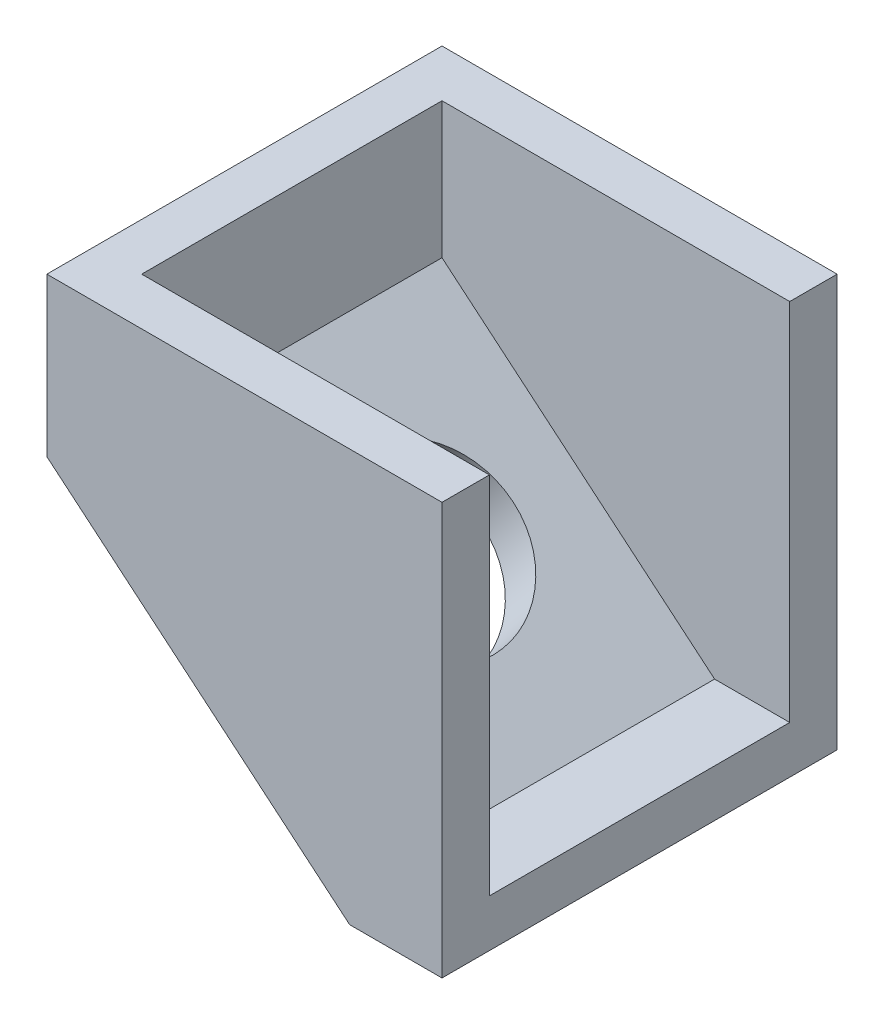
ISO-10303-21;
HEADER;
FILE_DESCRIPTION(('STEP AP214'),'2;1');
FILE_NAME('part.step','',(''),(''),'','','');
FILE_SCHEMA(('AUTOMOTIVE_DESIGN { 1 0 10303 214 1 1 1 1 }'));
ENDSEC;
DATA;
#1=APPLICATION_CONTEXT('core data for automotive mechanical design processes');
#2=APPLICATION_PROTOCOL_DEFINITION('international standard','automotive_design',2000,#1);
#3=PRODUCT_CONTEXT('',#1,'mechanical');
#4=PRODUCT('Part','Part','',(#3));
#5=PRODUCT_RELATED_PRODUCT_CATEGORY('part','',(#4));
#6=PRODUCT_DEFINITION_FORMATION('','',#4);
#7=PRODUCT_DEFINITION_CONTEXT('part definition',#1,'design');
#8=PRODUCT_DEFINITION('design','',#6,#7);
#9=PRODUCT_DEFINITION_SHAPE('','',#8);
#10=(LENGTH_UNIT() NAMED_UNIT(*) SI_UNIT(.MILLI.,.METRE.));
#11=(NAMED_UNIT(*) PLANE_ANGLE_UNIT() SI_UNIT($,.RADIAN.));
#12=(NAMED_UNIT(*) SI_UNIT($,.STERADIAN.) SOLID_ANGLE_UNIT());
#13=UNCERTAINTY_MEASURE_WITH_UNIT(LENGTH_MEASURE(1.E-05),#10,'distance_accuracy_value','');
#14=(GEOMETRIC_REPRESENTATION_CONTEXT(3) GLOBAL_UNCERTAINTY_ASSIGNED_CONTEXT((#13)) GLOBAL_UNIT_ASSIGNED_CONTEXT((#10,
#11,#12)) REPRESENTATION_CONTEXT('',''));
#15=CARTESIAN_POINT('',(0.,0.,0.));
#16=DIRECTION('',(0.,0.,1.));
#17=DIRECTION('',(1.,0.,0.));
#18=AXIS2_PLACEMENT_3D('',#15,#16,#17);
#19=CARTESIAN_POINT('',(0.,52.13,0.));
#20=DIRECTION('',(1.,0.,0.));
#21=DIRECTION('',(0.,0.,-1.));
#22=AXIS2_PLACEMENT_3D('',#19,#20,#21);
#23=PLANE('',#22);
#24=DIRECTION('',(0.,0.,1.));
#25=VECTOR('',#24,1.);
#26=CARTESIAN_POINT('',(0.,32.13,-52.13));
#27=LINE('',#26,#25);
#28=CARTESIAN_POINT('',(0.,32.13,-50.));
#29=VERTEX_POINT('',#28);
#30=CARTESIAN_POINT('',(0.,32.13,0.));
#31=VERTEX_POINT('',#30);
#32=EDGE_CURVE('E271',#29,#31,#27,.T.);
#33=ORIENTED_EDGE('',*,*,#32,.T.);
#34=DIRECTION('',(0.,-1.,0.));
#35=VECTOR('',#34,1.);
#36=CARTESIAN_POINT('',(0.,52.13,0.));
#37=LINE('',#36,#35);
#38=CARTESIAN_POINT('',(0.,52.13,0.));
#39=VERTEX_POINT('',#38);
#40=EDGE_CURVE('E248',#39,#31,#37,.T.);
#41=ORIENTED_EDGE('',*,*,#40,.F.);
#42=DIRECTION('',(0.,0.,1.));
#43=VECTOR('',#42,1.);
#44=CARTESIAN_POINT('',(0.,52.13,0.));
#45=LINE('',#44,#43);
#46=CARTESIAN_POINT('',(0.,52.13,-50.));
#47=VERTEX_POINT('',#46);
#48=EDGE_CURVE('E317',#47,#39,#45,.T.);
#49=ORIENTED_EDGE('',*,*,#48,.F.);
#50=DIRECTION('',(0.,-1.,0.));
#51=VECTOR('',#50,1.);
#52=CARTESIAN_POINT('',(0.,52.13,-50.));
#53=LINE('',#52,#51);
#54=EDGE_CURVE('E294',#47,#29,#53,.T.);
#55=ORIENTED_EDGE('',*,*,#54,.T.);
#56=EDGE_LOOP('',(#33,#41,#49,#55));
#57=FACE_BOUND('',#56,.T.);
#58=ADVANCED_FACE('F137',(#57),#23,.F.);
#59=CARTESIAN_POINT('',(50.,52.13,0.));
#60=DIRECTION('',(-1.,0.,0.));
#61=DIRECTION('',(0.,0.,1.));
#62=AXIS2_PLACEMENT_3D('',#59,#60,#61);
#63=PLANE('',#62);
#64=DIRECTION('',(0.,0.,-1.));
#65=VECTOR('',#64,1.);
#66=CARTESIAN_POINT('',(50.,52.13,0.));
#67=LINE('',#66,#65);
#68=CARTESIAN_POINT('',(50.,52.13,-44.));
#69=VERTEX_POINT('',#68);
#70=CARTESIAN_POINT('',(50.,52.13,-50.));
#71=VERTEX_POINT('',#70);
#72=EDGE_CURVE('E307',#69,#71,#67,.T.);
#73=ORIENTED_EDGE('',*,*,#72,.F.);
#74=DIRECTION('',(0.,1.,0.));
#75=VECTOR('',#74,1.);
#76=CARTESIAN_POINT('',(50.,0.,-44.));
#77=LINE('',#76,#75);
#78=CARTESIAN_POINT('',(50.,6.,-44.));
#79=VERTEX_POINT('',#78);
#80=EDGE_CURVE('E146',#79,#69,#77,.T.);
#81=ORIENTED_EDGE('',*,*,#80,.F.);
#82=DIRECTION('',(0.,0.,-1.));
#83=VECTOR('',#82,1.);
#84=CARTESIAN_POINT('',(50.,6.,54.9919413133499));
#85=LINE('',#84,#83);
#86=CARTESIAN_POINT('',(50.,6.,-6.));
#87=VERTEX_POINT('',#86);
#88=EDGE_CURVE('E224',#87,#79,#85,.T.);
#89=ORIENTED_EDGE('',*,*,#88,.F.);
#90=DIRECTION('',(0.,1.,0.));
#91=VECTOR('',#90,1.);
#92=CARTESIAN_POINT('',(50.,0.,-6.));
#93=LINE('',#92,#91);
#94=CARTESIAN_POINT('',(50.,52.13,-6.));
#95=VERTEX_POINT('',#94);
#96=EDGE_CURVE('E217',#87,#95,#93,.T.);
#97=ORIENTED_EDGE('',*,*,#96,.T.);
#98=DIRECTION('',(0.,0.,-1.));
#99=VECTOR('',#98,1.);
#100=CARTESIAN_POINT('',(50.,52.13,0.));
#101=LINE('',#100,#99);
#102=CARTESIAN_POINT('',(50.,52.13,0.));
#103=VERTEX_POINT('',#102);
#104=EDGE_CURVE('E223',#103,#95,#101,.T.);
#105=ORIENTED_EDGE('',*,*,#104,.F.);
#106=DIRECTION('',(0.,-1.,0.));
#107=VECTOR('',#106,1.);
#108=CARTESIAN_POINT('',(50.,52.13,0.));
#109=LINE('',#108,#107);
#110=CARTESIAN_POINT('',(50.,0.,0.));
#111=VERTEX_POINT('',#110);
#112=EDGE_CURVE('E244',#103,#111,#109,.T.);
#113=ORIENTED_EDGE('',*,*,#112,.T.);
#114=DIRECTION('',(0.,0.,-1.));
#115=VECTOR('',#114,1.);
#116=CARTESIAN_POINT('',(50.,0.,0.));
#117=LINE('',#116,#115);
#118=CARTESIAN_POINT('',(50.,0.,-50.));
#119=VERTEX_POINT('',#118);
#120=EDGE_CURVE('E298',#111,#119,#117,.T.);
#121=ORIENTED_EDGE('',*,*,#120,.T.);
#122=DIRECTION('',(0.,-1.,0.));
#123=VECTOR('',#122,1.);
#124=CARTESIAN_POINT('',(50.,52.13,-50.));
#125=LINE('',#124,#123);
#126=EDGE_CURVE('E289',#71,#119,#125,.T.);
#127=ORIENTED_EDGE('',*,*,#126,.F.);
#128=EDGE_LOOP('',(#73,#81,#89,#97,#105,#113,#121,#127));
#129=FACE_BOUND('',#128,.T.);
#130=ADVANCED_FACE('F220',(#129),#63,.F.);
#131=CARTESIAN_POINT('',(0.,52.13,0.));
#132=DIRECTION('',(0.,-1.,0.));
#133=DIRECTION('',(0.,0.,-1.));
#134=AXIS2_PLACEMENT_3D('',#131,#132,#133);
#135=PLANE('',#134);
#136=ORIENTED_EDGE('',*,*,#48,.T.);
#137=DIRECTION('',(1.,0.,0.));
#138=VECTOR('',#137,1.);
#139=CARTESIAN_POINT('',(0.,52.13,0.));
#140=LINE('',#139,#138);
#141=EDGE_CURVE('E241',#39,#103,#140,.T.);
#142=ORIENTED_EDGE('',*,*,#141,.T.);
#143=ORIENTED_EDGE('',*,*,#104,.T.);
#144=DIRECTION('',(1.,0.,0.));
#145=VECTOR('',#144,1.);
#146=CARTESIAN_POINT('',(0.,52.13,-6.));
#147=LINE('',#146,#145);
#148=CARTESIAN_POINT('',(6.,52.13,-6.));
#149=VERTEX_POINT('',#148);
#150=EDGE_CURVE('E229',#149,#95,#147,.T.);
#151=ORIENTED_EDGE('',*,*,#150,.F.);
#152=DIRECTION('',(0.,0.,-1.));
#153=VECTOR('',#152,1.);
#154=CARTESIAN_POINT('',(6.,52.13,54.9919413133499));
#155=LINE('',#154,#153);
#156=CARTESIAN_POINT('',(6.,52.13,-44.));
#157=VERTEX_POINT('',#156);
#158=EDGE_CURVE('E284',#149,#157,#155,.T.);
#159=ORIENTED_EDGE('',*,*,#158,.T.);
#160=DIRECTION('',(-1.,0.,0.));
#161=VECTOR('',#160,1.);
#162=CARTESIAN_POINT('',(0.,52.13,-44.));
#163=LINE('',#162,#161);
#164=EDGE_CURVE('E12',#69,#157,#163,.T.);
#165=ORIENTED_EDGE('',*,*,#164,.F.);
#166=ORIENTED_EDGE('',*,*,#72,.T.);
#167=DIRECTION('',(-1.,0.,0.));
#168=VECTOR('',#167,1.);
#169=CARTESIAN_POINT('',(0.,52.13,-50.));
#170=LINE('',#169,#168);
#171=EDGE_CURVE('E304',#71,#47,#170,.T.);
#172=ORIENTED_EDGE('',*,*,#171,.T.);
#173=EDGE_LOOP('',(#136,#142,#143,#151,#159,#165,#166,#172));
#174=FACE_BOUND('',#173,.T.);
#175=ADVANCED_FACE('F239',(#174),#135,.F.);
#176=CARTESIAN_POINT('',(0.,0.,0.));
#177=DIRECTION('',(0.,-1.,0.));
#178=DIRECTION('',(0.,0.,-1.));
#179=AXIS2_PLACEMENT_3D('',#176,#177,#178);
#180=PLANE('',#179);
#181=ORIENTED_EDGE('',*,*,#120,.F.);
#182=DIRECTION('',(1.,0.,0.));
#183=VECTOR('',#182,1.);
#184=CARTESIAN_POINT('',(0.,0.,0.));
#185=LINE('',#184,#183);
#186=CARTESIAN_POINT('',(38.3100913598493,0.,0.));
#187=VERTEX_POINT('',#186);
#188=EDGE_CURVE('E250',#187,#111,#185,.T.);
#189=ORIENTED_EDGE('',*,*,#188,.F.);
#190=DIRECTION('',(0.,0.,1.));
#191=VECTOR('',#190,1.);
#192=CARTESIAN_POINT('',(38.3100913598493,0.,0.));
#193=LINE('',#192,#191);
#194=CARTESIAN_POINT('',(38.3100913598493,0.,-50.));
#195=VERTEX_POINT('',#194);
#196=EDGE_CURVE('E303',#195,#187,#193,.T.);
#197=ORIENTED_EDGE('',*,*,#196,.F.);
#198=DIRECTION('',(-1.,0.,0.));
#199=VECTOR('',#198,1.);
#200=CARTESIAN_POINT('',(0.,0.,-50.));
#201=LINE('',#200,#199);
#202=EDGE_CURVE('E299',#119,#195,#201,.T.);
#203=ORIENTED_EDGE('',*,*,#202,.F.);
#204=EDGE_LOOP('',(#181,#189,#197,#203));
#205=FACE_BOUND('',#204,.T.);
#206=ADVANCED_FACE('F341',(#205),#180,.T.);
#207=CARTESIAN_POINT('',(38.3100913598493,0.,-52.13));
#208=DIRECTION('',(0.6426,0.766201827196986,0.));
#209=DIRECTION('',(-0.766201827196986,0.6426,0.));
#210=AXIS2_PLACEMENT_3D('',#207,#208,#209);
#211=PLANE('',#210);
#212=CARTESIAN_POINT('',(19.1550456799247,16.065,-25.));
#213=DIRECTION('',(-0.6426,-0.766201827196986,0.));
#214=DIRECTION('',(0.766201827196986,-0.6426,0.));
#215=AXIS2_PLACEMENT_3D('',#212,#213,#214);
#216=CIRCLE('',#215,11.);
#217=CARTESIAN_POINT('',(27.5832657790915,8.9964,-25.));
#218=VERTEX_POINT('',#217);
#219=EDGE_CURVE('E491',#218,#218,#216,.T.);
#220=ORIENTED_EDGE('',*,*,#219,.F.);
#221=EDGE_LOOP('',(#220));
#222=FACE_BOUND('',#221,.T.);
#223=ORIENTED_EDGE('',*,*,#196,.T.);
#224=DIRECTION('',(-0.766201827196986,0.6426,0.));
#225=VECTOR('',#224,1.);
#226=CARTESIAN_POINT('',(38.3100913598493,0.,0.));
#227=LINE('',#226,#225);
#228=EDGE_CURVE('E228',#187,#31,#227,.T.);
#229=ORIENTED_EDGE('',*,*,#228,.T.);
#230=ORIENTED_EDGE('',*,*,#32,.F.);
#231=DIRECTION('',(-0.766201827196986,0.6426,0.));
#232=VECTOR('',#231,1.);
#233=CARTESIAN_POINT('',(-9.84722588313567,40.3886952,-50.));
#234=LINE('',#233,#232);
#235=EDGE_CURVE('E293',#195,#29,#234,.T.);
#236=ORIENTED_EDGE('',*,*,#235,.F.);
#237=EDGE_LOOP('',(#223,#229,#230,#236));
#238=FACE_BOUND('',#237,.T.);
#239=ADVANCED_FACE('F329',(#222,#238),#211,.F.);
#240=CARTESIAN_POINT('',(0.,52.13,-50.));
#241=DIRECTION('',(0.,0.,1.));
#242=DIRECTION('',(1.,0.,0.));
#243=AXIS2_PLACEMENT_3D('',#240,#241,#242);
#244=PLANE('',#243);
#245=ORIENTED_EDGE('',*,*,#202,.T.);
#246=ORIENTED_EDGE('',*,*,#235,.T.);
#247=ORIENTED_EDGE('',*,*,#54,.F.);
#248=ORIENTED_EDGE('',*,*,#171,.F.);
#249=ORIENTED_EDGE('',*,*,#126,.T.);
#250=EDGE_LOOP('',(#245,#246,#247,#248,#249));
#251=FACE_BOUND('',#250,.T.);
#252=ADVANCED_FACE('F340',(#251),#244,.F.);
#253=CARTESIAN_POINT('',(0.,0.,-44.));
#254=DIRECTION('',(0.,0.,-1.));
#255=DIRECTION('',(-1.,0.,0.));
#256=AXIS2_PLACEMENT_3D('',#253,#254,#255);
#257=PLANE('',#256);
#258=DIRECTION('',(-0.766201827196986,0.6426,0.));
#259=VECTOR('',#258,1.);
#260=CARTESIAN_POINT('',(19.6751683812574,23.4596171243819,-44.));
#261=LINE('',#260,#259);
#262=CARTESIAN_POINT('',(40.4930808351342,6.,-44.));
#263=VERTEX_POINT('',#262);
#264=CARTESIAN_POINT('',(6.,34.9287403891282,-44.));
#265=VERTEX_POINT('',#264);
#266=EDGE_CURVE('E154',#263,#265,#261,.T.);
#267=ORIENTED_EDGE('',*,*,#266,.F.);
#268=DIRECTION('',(1.,0.,0.));
#269=VECTOR('',#268,1.);
#270=CARTESIAN_POINT('',(0.,6.,-44.));
#271=LINE('',#270,#269);
#272=EDGE_CURVE('E265',#263,#79,#271,.T.);
#273=ORIENTED_EDGE('',*,*,#272,.T.);
#274=ORIENTED_EDGE('',*,*,#80,.T.);
#275=ORIENTED_EDGE('',*,*,#164,.T.);
#276=DIRECTION('',(0.,-1.,0.));
#277=VECTOR('',#276,1.);
#278=CARTESIAN_POINT('',(6.00000000000001,0.,-44.));
#279=LINE('',#278,#277);
#280=EDGE_CURVE('E260',#157,#265,#279,.T.);
#281=ORIENTED_EDGE('',*,*,#280,.T.);
#282=EDGE_LOOP('',(#267,#273,#274,#275,#281));
#283=FACE_BOUND('',#282,.T.);
#284=ADVANCED_FACE('F373',(#283),#257,.F.);
#285=CARTESIAN_POINT('',(19.6751683812574,23.4596171243819,54.9919413133499));
#286=DIRECTION('',(-0.6426,-0.766201827196986,0.));
#287=DIRECTION('',(0.766201827196986,-0.6426,0.));
#288=AXIS2_PLACEMENT_3D('',#285,#286,#287);
#289=PLANE('',#288);
#290=CARTESIAN_POINT('',(23.0106456799247,20.6622109631819,-25.));
#291=DIRECTION('',(-0.6426,-0.766201827196986,0.));
#292=DIRECTION('',(0.766201827196986,-0.6426,0.));
#293=AXIS2_PLACEMENT_3D('',#290,#291,#292);
#294=CIRCLE('',#293,11.);
#295=CARTESIAN_POINT('',(31.4388657790915,13.5936109631819,-25.));
#296=VERTEX_POINT('',#295);
#297=EDGE_CURVE('E140',#296,#296,#294,.T.);
#298=ORIENTED_EDGE('',*,*,#297,.T.);
#299=EDGE_LOOP('',(#298));
#300=FACE_BOUND('',#299,.T.);
#301=DIRECTION('',(-0.766201827196986,0.6426,0.));
#302=VECTOR('',#301,1.);
#303=CARTESIAN_POINT('',(19.6751683812574,23.4596171243819,-6.));
#304=LINE('',#303,#302);
#305=CARTESIAN_POINT('',(40.4930808351342,6.,-6.));
#306=VERTEX_POINT('',#305);
#307=CARTESIAN_POINT('',(6.,34.9287403891282,-6.));
#308=VERTEX_POINT('',#307);
#309=EDGE_CURVE('E268',#306,#308,#304,.T.);
#310=ORIENTED_EDGE('',*,*,#309,.F.);
#311=DIRECTION('',(0.,0.,-1.));
#312=VECTOR('',#311,1.);
#313=CARTESIAN_POINT('',(40.4930808351342,6.,54.9919413133499));
#314=LINE('',#313,#312);
#315=EDGE_CURVE('E264',#306,#263,#314,.T.);
#316=ORIENTED_EDGE('',*,*,#315,.T.);
#317=ORIENTED_EDGE('',*,*,#266,.T.);
#318=DIRECTION('',(0.,0.,-1.));
#319=VECTOR('',#318,1.);
#320=CARTESIAN_POINT('',(6.,34.9287403891282,54.9919413133499));
#321=LINE('',#320,#319);
#322=EDGE_CURVE('E263',#308,#265,#321,.T.);
#323=ORIENTED_EDGE('',*,*,#322,.F.);
#324=EDGE_LOOP('',(#310,#316,#317,#323));
#325=FACE_BOUND('',#324,.T.);
#326=ADVANCED_FACE('F378',(#300,#325),#289,.F.);
#327=CARTESIAN_POINT('',(0.,6.,54.9919413133499));
#328=DIRECTION('',(0.,1.,0.));
#329=DIRECTION('',(0.,0.,1.));
#330=AXIS2_PLACEMENT_3D('',#327,#328,#329);
#331=PLANE('',#330);
#332=ORIENTED_EDGE('',*,*,#315,.F.);
#333=DIRECTION('',(1.,0.,0.));
#334=VECTOR('',#333,1.);
#335=CARTESIAN_POINT('',(0.,6.,-6.));
#336=LINE('',#335,#334);
#337=EDGE_CURVE('E272',#306,#87,#336,.T.);
#338=ORIENTED_EDGE('',*,*,#337,.T.);
#339=ORIENTED_EDGE('',*,*,#88,.T.);
#340=ORIENTED_EDGE('',*,*,#272,.F.);
#341=EDGE_LOOP('',(#332,#338,#339,#340));
#342=FACE_BOUND('',#341,.T.);
#343=ADVANCED_FACE('F380',(#342),#331,.T.);
#344=CARTESIAN_POINT('',(6.00000000000001,0.,54.9919413133499));
#345=DIRECTION('',(1.,0.,0.));
#346=DIRECTION('',(0.,1.,0.));
#347=AXIS2_PLACEMENT_3D('',#344,#345,#346);
#348=PLANE('',#347);
#349=ORIENTED_EDGE('',*,*,#158,.F.);
#350=DIRECTION('',(0.,-1.,0.));
#351=VECTOR('',#350,1.);
#352=CARTESIAN_POINT('',(6.00000000000001,0.,-6.));
#353=LINE('',#352,#351);
#354=EDGE_CURVE('E234',#149,#308,#353,.T.);
#355=ORIENTED_EDGE('',*,*,#354,.T.);
#356=ORIENTED_EDGE('',*,*,#322,.T.);
#357=ORIENTED_EDGE('',*,*,#280,.F.);
#358=EDGE_LOOP('',(#349,#355,#356,#357));
#359=FACE_BOUND('',#358,.T.);
#360=ADVANCED_FACE('F392',(#359),#348,.T.);
#361=CARTESIAN_POINT('',(0.,52.13,0.));
#362=DIRECTION('',(0.,0.,-1.));
#363=DIRECTION('',(-1.,0.,0.));
#364=AXIS2_PLACEMENT_3D('',#361,#362,#363);
#365=PLANE('',#364);
#366=ORIENTED_EDGE('',*,*,#40,.T.);
#367=ORIENTED_EDGE('',*,*,#228,.F.);
#368=ORIENTED_EDGE('',*,*,#188,.T.);
#369=ORIENTED_EDGE('',*,*,#112,.F.);
#370=ORIENTED_EDGE('',*,*,#141,.F.);
#371=EDGE_LOOP('',(#366,#367,#368,#369,#370));
#372=FACE_BOUND('',#371,.T.);
#373=ADVANCED_FACE('F334',(#372),#365,.F.);
#374=CARTESIAN_POINT('',(0.,0.,-6.));
#375=DIRECTION('',(0.,0.,1.));
#376=DIRECTION('',(1.,0.,0.));
#377=AXIS2_PLACEMENT_3D('',#374,#375,#376);
#378=PLANE('',#377);
#379=ORIENTED_EDGE('',*,*,#337,.F.);
#380=ORIENTED_EDGE('',*,*,#309,.T.);
#381=ORIENTED_EDGE('',*,*,#354,.F.);
#382=ORIENTED_EDGE('',*,*,#150,.T.);
#383=ORIENTED_EDGE('',*,*,#96,.F.);
#384=EDGE_LOOP('',(#379,#380,#381,#382,#383));
#385=FACE_BOUND('',#384,.T.);
#386=ADVANCED_FACE('F232',(#385),#378,.F.);
#387=CARTESIAN_POINT('',(52.6537836799247,56.0071012517789,-25.));
#388=DIRECTION('',(-0.6426,-0.766201827196986,0.));
#389=DIRECTION('',(0.766201827196986,-0.6426,0.));
#390=AXIS2_PLACEMENT_3D('',#387,#388,#389);
#391=CYLINDRICAL_SURFACE('',#390,11.);
#392=ORIENTED_EDGE('',*,*,#219,.T.);
#393=EDGE_LOOP('',(#392));
#394=FACE_BOUND('',#393,.T.);
#395=ORIENTED_EDGE('',*,*,#297,.F.);
#396=EDGE_LOOP('',(#395));
#397=FACE_BOUND('',#396,.T.);
#398=ADVANCED_FACE('F420',(#394,#397),#391,.F.);
#399=CLOSED_SHELL('',(#58,#130,#175,#206,#239,#252,#284,#326,#343,#360,#373,#386,#398));
#400=MANIFOLD_SOLID_BREP('B2',#399);
#401=ADVANCED_BREP_SHAPE_REPRESENTATION('',(#18,#400),#14);
#402=SHAPE_DEFINITION_REPRESENTATION(#9,#401);
ENDSEC;
END-ISO-10303-21;
